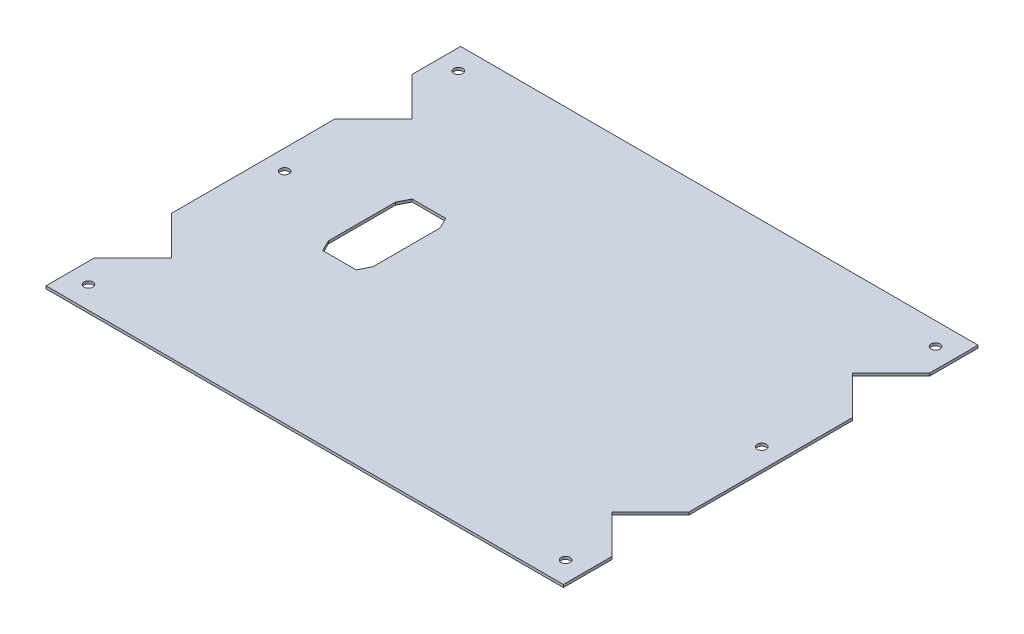
ISO-10303-21;
HEADER;
FILE_DESCRIPTION(('STEP AP214'),'2;1');
FILE_NAME('part.step','',(''),(''),'','','');
FILE_SCHEMA(('AUTOMOTIVE_DESIGN { 1 0 10303 214 1 1 1 1 }'));
ENDSEC;
DATA;
#1=APPLICATION_CONTEXT('core data for automotive mechanical design processes');
#2=APPLICATION_PROTOCOL_DEFINITION('international standard','automotive_design',2000,#1);
#3=PRODUCT_CONTEXT('',#1,'mechanical');
#4=PRODUCT('Part','Part','',(#3));
#5=PRODUCT_RELATED_PRODUCT_CATEGORY('part','',(#4));
#6=PRODUCT_DEFINITION_FORMATION('','',#4);
#7=PRODUCT_DEFINITION_CONTEXT('part definition',#1,'design');
#8=PRODUCT_DEFINITION('design','',#6,#7);
#9=PRODUCT_DEFINITION_SHAPE('','',#8);
#10=(LENGTH_UNIT() NAMED_UNIT(*) SI_UNIT(.MILLI.,.METRE.));
#11=(NAMED_UNIT(*) PLANE_ANGLE_UNIT() SI_UNIT($,.RADIAN.));
#12=(NAMED_UNIT(*) SI_UNIT($,.STERADIAN.) SOLID_ANGLE_UNIT());
#13=UNCERTAINTY_MEASURE_WITH_UNIT(LENGTH_MEASURE(1.E-05),#10,'distance_accuracy_value','');
#14=(GEOMETRIC_REPRESENTATION_CONTEXT(3) GLOBAL_UNCERTAINTY_ASSIGNED_CONTEXT((#13)) GLOBAL_UNIT_ASSIGNED_CONTEXT((#10,
#11,#12)) REPRESENTATION_CONTEXT('',''));
#15=CARTESIAN_POINT('',(0.,0.,0.));
#16=DIRECTION('',(0.,0.,1.));
#17=DIRECTION('',(1.,0.,0.));
#18=AXIS2_PLACEMENT_3D('',#15,#16,#17);
#19=CARTESIAN_POINT('',(0.,-1.2,0.));
#20=DIRECTION('',(0.,1.,0.));
#21=DIRECTION('',(0.,0.,1.));
#22=AXIS2_PLACEMENT_3D('',#19,#20,#21);
#23=PLANE('',#22);
#24=DIRECTION('',(0.707106781186545,0.,-0.70710678118655));
#25=VECTOR('',#24,1.);
#26=CARTESIAN_POINT('',(99.9739821162841,-1.20000000000001,52.4464466094067));
#27=LINE('',#26,#25);
#28=CARTESIAN_POINT('',(98.5334376675488,-1.2,53.8869910581421));
#29=VERTEX_POINT('',#28);
#30=CARTESIAN_POINT('',(115.773982116284,-1.20000000000012,36.6464466094066));
#31=VERTEX_POINT('',#30);
#32=EDGE_CURVE('E705',#29,#31,#27,.T.);
#33=ORIENTED_EDGE('',*,*,#32,.F.);
#34=DIRECTION('',(-0.707106781186543,0.,-0.707106781186552));
#35=VECTOR('',#34,1.);
#36=CARTESIAN_POINT('',(128.725646100053,-1.20000000000019,84.0791994906469));
#37=LINE('',#36,#35);
#38=CARTESIAN_POINT('',(115.773982116284,-1.20000000000012,71.1275355068776));
#39=VERTEX_POINT('',#38);
#40=EDGE_CURVE('E720',#39,#29,#37,.T.);
#41=ORIENTED_EDGE('',*,*,#40,.F.);
#42=DIRECTION('',(0.,0.,1.));
#43=VECTOR('',#42,1.);
#44=CARTESIAN_POINT('',(115.773982116284,-1.20000000000011,53.9739821162842));
#45=LINE('',#44,#43);
#46=CARTESIAN_POINT('',(115.773982116284,-1.20000000000011,92.7739821162842));
#47=VERTEX_POINT('',#46);
#48=EDGE_CURVE('E716',#39,#47,#45,.T.);
#49=ORIENTED_EDGE('',*,*,#48,.T.);
#50=DIRECTION('',(-1.,0.,0.));
#51=VECTOR('',#50,1.);
#52=CARTESIAN_POINT('',(152.773982116284,-1.20000000000036,92.7739821162843));
#53=LINE('',#52,#51);
#54=CARTESIAN_POINT('',(-115.773982116284,-1.20000000000011,92.7739821162842));
#55=VERTEX_POINT('',#54);
#56=EDGE_CURVE('E747',#47,#55,#53,.T.);
#57=ORIENTED_EDGE('',*,*,#56,.T.);
#58=DIRECTION('',(0.,0.,-1.));
#59=VECTOR('',#58,1.);
#60=CARTESIAN_POINT('',(-115.773982116284,-1.20000000000011,53.9739821162842));
#61=LINE('',#60,#59);
#62=CARTESIAN_POINT('',(-115.773982116284,-1.20000000000012,71.1275355068776));
#63=VERTEX_POINT('',#62);
#64=EDGE_CURVE('E741',#55,#63,#61,.T.);
#65=ORIENTED_EDGE('',*,*,#64,.T.);
#66=DIRECTION('',(-0.707106781186543,0.,0.707106781186552));
#67=VECTOR('',#66,1.);
#68=CARTESIAN_POINT('',(-99.9739821162842,-1.20000000000001,55.3275355068774));
#69=LINE('',#68,#67);
#70=CARTESIAN_POINT('',(-98.5334376675488,-1.19999999999999,53.886991058142));
#71=VERTEX_POINT('',#70);
#72=EDGE_CURVE('E739',#71,#63,#69,.T.);
#73=ORIENTED_EDGE('',*,*,#72,.F.);
#74=DIRECTION('',(0.707106781186545,0.,0.70710678118655));
#75=VECTOR('',#74,1.);
#76=CARTESIAN_POINT('',(-174.98597798299,-1.20000000000053,-22.5655492572994));
#77=LINE('',#76,#75);
#78=CARTESIAN_POINT('',(-115.773982116284,-1.20000000000012,36.6464466094066));
#79=VERTEX_POINT('',#78);
#80=EDGE_CURVE('E855',#79,#71,#77,.T.);
#81=ORIENTED_EDGE('',*,*,#80,.F.);
#82=DIRECTION('',(0.,0.,-1.));
#83=VECTOR('',#82,1.);
#84=CARTESIAN_POINT('',(-115.773982116284,-1.20000000000013,0.));
#85=LINE('',#84,#83);
#86=CARTESIAN_POINT('',(-115.773982116284,-1.20000000000015,-36.6464466094067));
#87=VERTEX_POINT('',#86);
#88=EDGE_CURVE('E861',#79,#87,#85,.T.);
#89=ORIENTED_EDGE('',*,*,#88,.T.);
#90=DIRECTION('',(-0.707106781186546,0.,0.707106781186549));
#91=VECTOR('',#90,1.);
#92=CARTESIAN_POINT('',(-99.9739821162841,-1.20000000000003,-52.4464466094067));
#93=LINE('',#92,#91);
#94=CARTESIAN_POINT('',(-98.5334376675488,-1.20000000000004,-53.8869910581421));
#95=VERTEX_POINT('',#94);
#96=EDGE_CURVE('E846',#95,#87,#93,.T.);
#97=ORIENTED_EDGE('',*,*,#96,.F.);
#98=DIRECTION('',(0.707106781186546,0.,0.707106781186549));
#99=VECTOR('',#98,1.);
#100=CARTESIAN_POINT('',(-128.725646100053,-1.20000000000042,-84.0791994906468));
#101=LINE('',#100,#99);
#102=CARTESIAN_POINT('',(-115.773982116284,-1.20000000000024,-71.1275355068775));
#103=VERTEX_POINT('',#102);
#104=EDGE_CURVE('E773',#103,#95,#101,.T.);
#105=ORIENTED_EDGE('',*,*,#104,.F.);
#106=DIRECTION('',(0.,0.,-1.));
#107=VECTOR('',#106,1.);
#108=CARTESIAN_POINT('',(-115.773982116284,-1.20000000000012,-53.9739821162839));
#109=LINE('',#108,#107);
#110=CARTESIAN_POINT('',(-115.773982116284,-1.2000000000004,-92.7739821162842));
#111=VERTEX_POINT('',#110);
#112=EDGE_CURVE('E784',#103,#111,#109,.T.);
#113=ORIENTED_EDGE('',*,*,#112,.T.);
#114=DIRECTION('',(1.,0.,0.));
#115=VECTOR('',#114,1.);
#116=CARTESIAN_POINT('',(152.773982116284,-1.20000000000064,-92.7739821162841));
#117=LINE('',#116,#115);
#118=CARTESIAN_POINT('',(115.773982116284,-1.2000000000004,-92.7739821162842));
#119=VERTEX_POINT('',#118);
#120=EDGE_CURVE('E793',#111,#119,#117,.T.);
#121=ORIENTED_EDGE('',*,*,#120,.T.);
#122=DIRECTION('',(0.,0.,1.));
#123=VECTOR('',#122,1.);
#124=CARTESIAN_POINT('',(115.773982116284,-1.20000000000012,-53.9739821162839));
#125=LINE('',#124,#123);
#126=CARTESIAN_POINT('',(115.773982116284,-1.20000000000024,-71.1275355068775));
#127=VERTEX_POINT('',#126);
#128=EDGE_CURVE('E790',#119,#127,#125,.T.);
#129=ORIENTED_EDGE('',*,*,#128,.T.);
#130=DIRECTION('',(0.707106781186546,0.,-0.707106781186549));
#131=VECTOR('',#130,1.);
#132=CARTESIAN_POINT('',(99.9739821162841,-1.20000000000001,-55.3275355068774));
#133=LINE('',#132,#131);
#134=CARTESIAN_POINT('',(98.5334376675488,-1.2,-53.8869910581421));
#135=VERTEX_POINT('',#134);
#136=EDGE_CURVE('E782',#135,#127,#133,.T.);
#137=ORIENTED_EDGE('',*,*,#136,.F.);
#138=DIRECTION('',(-0.707106781186546,0.,-0.707106781186549));
#139=VECTOR('',#138,1.);
#140=CARTESIAN_POINT('',(174.98597798299,-1.20000000000053,22.5655492572993));
#141=LINE('',#140,#139);
#142=CARTESIAN_POINT('',(115.773982116284,-1.20000000000012,-36.6464466094067));
#143=VERTEX_POINT('',#142);
#144=EDGE_CURVE('E828',#143,#135,#141,.T.);
#145=ORIENTED_EDGE('',*,*,#144,.F.);
#146=DIRECTION('',(0.,0.,1.));
#147=VECTOR('',#146,1.);
#148=CARTESIAN_POINT('',(115.773982116284,-1.20000000000012,0.));
#149=LINE('',#148,#147);
#150=EDGE_CURVE('E834',#143,#31,#149,.T.);
#151=ORIENTED_EDGE('',*,*,#150,.T.);
#152=EDGE_LOOP('',(#33,#41,#49,#57,#65,#73,#81,#89,#97,#105,#113,#121,#129,#137,#145,#151));
#153=FACE_BOUND('',#152,.T.);
#154=DIRECTION('',(0.,0.,-1.));
#155=VECTOR('',#154,1.);
#156=CARTESIAN_POINT('',(-70.,-1.2,12.2));
#157=LINE('',#156,#155);
#158=CARTESIAN_POINT('',(-70.,-1.2,12.2));
#159=VERTEX_POINT('',#158);
#160=CARTESIAN_POINT('',(-70.,-1.2,-17.8));
#161=VERTEX_POINT('',#160);
#162=EDGE_CURVE('E871',#159,#161,#157,.T.);
#163=ORIENTED_EDGE('',*,*,#162,.F.);
#164=DIRECTION('',(-0.447213595499958,0.,-0.894427190999916));
#165=VECTOR('',#164,1.);
#166=CARTESIAN_POINT('',(-70.,-1.2,12.2));
#167=LINE('',#166,#165);
#168=CARTESIAN_POINT('',(-67.5,-1.2,17.2));
#169=VERTEX_POINT('',#168);
#170=EDGE_CURVE('E548',#169,#159,#167,.T.);
#171=ORIENTED_EDGE('',*,*,#170,.F.);
#172=DIRECTION('',(-1.,0.,0.));
#173=VECTOR('',#172,1.);
#174=CARTESIAN_POINT('',(-67.5,-1.2,17.2));
#175=LINE('',#174,#173);
#176=CARTESIAN_POINT('',(-52.5,-1.2,17.2));
#177=VERTEX_POINT('',#176);
#178=EDGE_CURVE('E888',#177,#169,#175,.T.);
#179=ORIENTED_EDGE('',*,*,#178,.F.);
#180=DIRECTION('',(-0.447213595499956,0.,0.894427190999917));
#181=VECTOR('',#180,1.);
#182=CARTESIAN_POINT('',(-52.5,-1.2,17.2));
#183=LINE('',#182,#181);
#184=CARTESIAN_POINT('',(-50.,-1.2,12.2));
#185=VERTEX_POINT('',#184);
#186=EDGE_CURVE('E885',#185,#177,#183,.T.);
#187=ORIENTED_EDGE('',*,*,#186,.F.);
#188=DIRECTION('',(0.,0.,1.));
#189=VECTOR('',#188,1.);
#190=CARTESIAN_POINT('',(-50.,-1.2,12.2));
#191=LINE('',#190,#189);
#192=CARTESIAN_POINT('',(-50.,-1.2,-17.8));
#193=VERTEX_POINT('',#192);
#194=EDGE_CURVE('E882',#193,#185,#191,.T.);
#195=ORIENTED_EDGE('',*,*,#194,.F.);
#196=DIRECTION('',(0.447213595499956,0.,0.894427190999917));
#197=VECTOR('',#196,1.);
#198=CARTESIAN_POINT('',(-52.5,-1.2,-22.8));
#199=LINE('',#198,#197);
#200=CARTESIAN_POINT('',(-52.5,-1.2,-22.8));
#201=VERTEX_POINT('',#200);
#202=EDGE_CURVE('E879',#201,#193,#199,.T.);
#203=ORIENTED_EDGE('',*,*,#202,.F.);
#204=DIRECTION('',(1.,0.,0.));
#205=VECTOR('',#204,1.);
#206=CARTESIAN_POINT('',(-67.5,-1.2,-22.8));
#207=LINE('',#206,#205);
#208=CARTESIAN_POINT('',(-67.5,-1.2,-22.8));
#209=VERTEX_POINT('',#208);
#210=EDGE_CURVE('E876',#209,#201,#207,.T.);
#211=ORIENTED_EDGE('',*,*,#210,.F.);
#212=DIRECTION('',(0.44721359549996,0.,-0.894427190999915));
#213=VECTOR('',#212,1.);
#214=CARTESIAN_POINT('',(-70.,-1.2,-17.8));
#215=LINE('',#214,#213);
#216=EDGE_CURVE('E873',#161,#209,#215,.T.);
#217=ORIENTED_EDGE('',*,*,#216,.F.);
#218=EDGE_LOOP('',(#163,#171,#179,#187,#195,#203,#211,#217));
#219=FACE_BOUND('',#218,.T.);
#220=CARTESIAN_POINT('',(-106.773982116284,-1.20000000000012,-5.00000000000015));
#221=DIRECTION('',(0.,1.,0.));
#222=DIRECTION('',(0.,0.,-1.));
#223=AXIS2_PLACEMENT_3D('',#220,#221,#222);
#224=CIRCLE('',#223,2.);
#225=CARTESIAN_POINT('',(-106.773982116284,-1.20000000000012,-7.00000000000015));
#226=VERTEX_POINT('',#225);
#227=EDGE_CURVE('E863',#226,#226,#224,.T.);
#228=ORIENTED_EDGE('',*,*,#227,.T.);
#229=EDGE_LOOP('',(#228));
#230=FACE_BOUND('',#229,.T.);
#231=CARTESIAN_POINT('',(106.773982116284,-1.20000000000009,-5.00000000000015));
#232=DIRECTION('',(0.,-1.,0.));
#233=DIRECTION('',(0.,0.,-1.));
#234=AXIS2_PLACEMENT_3D('',#231,#232,#233);
#235=CIRCLE('',#234,2.);
#236=CARTESIAN_POINT('',(106.773982116284,-1.20000000000009,-7.00000000000015));
#237=VERTEX_POINT('',#236);
#238=EDGE_CURVE('E836',#237,#237,#235,.T.);
#239=ORIENTED_EDGE('',*,*,#238,.F.);
#240=EDGE_LOOP('',(#239));
#241=FACE_BOUND('',#240,.T.);
#242=CARTESIAN_POINT('',(-106.773982116284,-1.20000000000027,-82.7739821162841));
#243=DIRECTION('',(0.,1.,0.));
#244=DIRECTION('',(1.,0.,0.));
#245=AXIS2_PLACEMENT_3D('',#242,#243,#244);
#246=CIRCLE('',#245,2.);
#247=CARTESIAN_POINT('',(-104.773982116284,-1.20000000000026,-82.7739821162841));
#248=VERTEX_POINT('',#247);
#249=EDGE_CURVE('E787',#248,#248,#246,.T.);
#250=ORIENTED_EDGE('',*,*,#249,.T.);
#251=EDGE_LOOP('',(#250));
#252=FACE_BOUND('',#251,.T.);
#253=CARTESIAN_POINT('',(106.773982116284,-1.20000000000028,-82.7739821162841));
#254=DIRECTION('',(0.,-1.,0.));
#255=DIRECTION('',(-1.,0.,0.));
#256=AXIS2_PLACEMENT_3D('',#253,#254,#255);
#257=CIRCLE('',#256,2.);
#258=CARTESIAN_POINT('',(104.773982116284,-1.20000000000028,-82.7739821162841));
#259=VERTEX_POINT('',#258);
#260=EDGE_CURVE('E818',#259,#259,#257,.T.);
#261=ORIENTED_EDGE('',*,*,#260,.F.);
#262=EDGE_LOOP('',(#261));
#263=FACE_BOUND('',#262,.T.);
#264=CARTESIAN_POINT('',(-106.773982116284,-1.2000000000001,82.7739821162842));
#265=DIRECTION('',(0.,1.,0.));
#266=DIRECTION('',(-1.,0.,0.));
#267=AXIS2_PLACEMENT_3D('',#264,#265,#266);
#268=CIRCLE('',#267,2.);
#269=CARTESIAN_POINT('',(-108.773982116284,-1.2000000000001,82.7739821162842));
#270=VERTEX_POINT('',#269);
#271=EDGE_CURVE('E744',#270,#270,#268,.T.);
#272=ORIENTED_EDGE('',*,*,#271,.T.);
#273=EDGE_LOOP('',(#272));
#274=FACE_BOUND('',#273,.T.);
#275=CARTESIAN_POINT('',(106.773982116284,-1.20000000000007,82.7739821162842));
#276=DIRECTION('',(0.,-1.,0.));
#277=DIRECTION('',(1.,0.,0.));
#278=AXIS2_PLACEMENT_3D('',#275,#276,#277);
#279=CIRCLE('',#278,2.);
#280=CARTESIAN_POINT('',(108.773982116284,-1.20000000000008,82.7739821162842));
#281=VERTEX_POINT('',#280);
#282=EDGE_CURVE('E763',#281,#281,#279,.T.);
#283=ORIENTED_EDGE('',*,*,#282,.F.);
#284=EDGE_LOOP('',(#283));
#285=FACE_BOUND('',#284,.T.);
#286=ADVANCED_FACE('F533',(#153,#219,#230,#241,#252,#263,#274,#285),#23,.F.);
#287=CARTESIAN_POINT('',(0.,0.,0.));
#288=DIRECTION('',(0.,1.,0.));
#289=DIRECTION('',(0.,0.,1.));
#290=AXIS2_PLACEMENT_3D('',#287,#288,#289);
#291=PLANE('',#290);
#292=DIRECTION('',(-0.707106781186543,0.,-0.707106781186552));
#293=VECTOR('',#292,1.);
#294=CARTESIAN_POINT('',(125.697205420987,-1.73472347597681E-13,81.0507588115807));
#295=LINE('',#294,#293);
#296=CARTESIAN_POINT('',(115.773982116284,-1.11022302462516E-13,71.1275355068776));
#297=VERTEX_POINT('',#296);
#298=CARTESIAN_POINT('',(98.5334376675488,0.,53.8869910581421));
#299=VERTEX_POINT('',#298);
#300=EDGE_CURVE('E710',#297,#299,#295,.T.);
#301=ORIENTED_EDGE('',*,*,#300,.T.);
#302=DIRECTION('',(0.707106781186545,0.,-0.70710678118655));
#303=VECTOR('',#302,1.);
#304=CARTESIAN_POINT('',(125.697205420987,-1.94289029309402E-13,26.7232233047033));
#305=LINE('',#304,#303);
#306=CARTESIAN_POINT('',(115.773982116284,0.,36.6464466094066));
#307=VERTEX_POINT('',#306);
#308=EDGE_CURVE('E695',#299,#307,#305,.T.);
#309=ORIENTED_EDGE('',*,*,#308,.T.);
#310=DIRECTION('',(0.,0.,-1.));
#311=VECTOR('',#310,1.);
#312=CARTESIAN_POINT('',(115.773982116284,-1.11022302462516E-13,52.8));
#313=LINE('',#312,#311);
#314=CARTESIAN_POINT('',(115.773982116284,0.,-36.6464466094067));
#315=VERTEX_POINT('',#314);
#316=EDGE_CURVE('E776',#315,#307,#313,.F.);
#317=ORIENTED_EDGE('',*,*,#316,.F.);
#318=DIRECTION('',(-0.707106781186546,0.,-0.707106781186549));
#319=VECTOR('',#318,1.);
#320=CARTESIAN_POINT('',(125.697205420987,-1.80411241501588E-13,-26.7232233047034));
#321=LINE('',#320,#319);
#322=CARTESIAN_POINT('',(98.5334376675488,0.,-53.8869910581421));
#323=VERTEX_POINT('',#322);
#324=EDGE_CURVE('E706',#315,#323,#321,.T.);
#325=ORIENTED_EDGE('',*,*,#324,.T.);
#326=DIRECTION('',(0.707106781186546,0.,-0.707106781186549));
#327=VECTOR('',#326,1.);
#328=CARTESIAN_POINT('',(125.697205420987,-3.7470027081099E-13,-81.0507588115805));
#329=LINE('',#328,#327);
#330=CARTESIAN_POINT('',(115.773982116284,-2.28983498828939E-13,-71.1275355068775));
#331=VERTEX_POINT('',#330);
#332=EDGE_CURVE('E801',#323,#331,#329,.T.);
#333=ORIENTED_EDGE('',*,*,#332,.T.);
#334=DIRECTION('',(0.,0.,-1.));
#335=VECTOR('',#334,1.);
#336=CARTESIAN_POINT('',(115.773982116284,-1.17961196366423E-13,-54.9739821162841));
#337=LINE('',#336,#335);
#338=CARTESIAN_POINT('',(115.773982116284,-3.88578058618805E-13,-92.7739821162842));
#339=VERTEX_POINT('',#338);
#340=EDGE_CURVE('E804',#339,#331,#337,.F.);
#341=ORIENTED_EDGE('',*,*,#340,.F.);
#342=DIRECTION('',(-1.,0.,0.));
#343=VECTOR('',#342,1.);
#344=CARTESIAN_POINT('',(115.773982116284,-3.88578058618805E-13,-92.7739821162842));
#345=LINE('',#344,#343);
#346=CARTESIAN_POINT('',(-115.773982116284,-3.88578058618805E-13,-92.7739821162842));
#347=VERTEX_POINT('',#346);
#348=EDGE_CURVE('E816',#347,#339,#345,.F.);
#349=ORIENTED_EDGE('',*,*,#348,.F.);
#350=DIRECTION('',(0.,0.,1.));
#351=VECTOR('',#350,1.);
#352=CARTESIAN_POINT('',(-115.773982116284,-3.88578058618805E-13,-92.7739821162842));
#353=LINE('',#352,#351);
#354=CARTESIAN_POINT('',(-115.773982116284,-2.28983498828939E-13,-71.1275355068775));
#355=VERTEX_POINT('',#354);
#356=EDGE_CURVE('E798',#355,#347,#353,.F.);
#357=ORIENTED_EDGE('',*,*,#356,.F.);
#358=DIRECTION('',(0.707106781186546,0.,0.707106781186549));
#359=VECTOR('',#358,1.);
#360=CARTESIAN_POINT('',(-125.697205420987,-3.7470027081099E-13,-81.0507588115805));
#361=LINE('',#360,#359);
#362=CARTESIAN_POINT('',(-98.5334376675488,0.,-53.8869910581421));
#363=VERTEX_POINT('',#362);
#364=EDGE_CURVE('E795',#355,#363,#361,.T.);
#365=ORIENTED_EDGE('',*,*,#364,.T.);
#366=DIRECTION('',(-0.707106781186546,0.,0.707106781186549));
#367=VECTOR('',#366,1.);
#368=CARTESIAN_POINT('',(-125.697205420987,-2.08166817117217E-13,-26.7232233047034));
#369=LINE('',#368,#367);
#370=CARTESIAN_POINT('',(-115.773982116284,-1.11022302462516E-13,-36.6464466094067));
#371=VERTEX_POINT('',#370);
#372=EDGE_CURVE('E849',#363,#371,#369,.T.);
#373=ORIENTED_EDGE('',*,*,#372,.T.);
#374=DIRECTION('',(0.,0.,1.));
#375=VECTOR('',#374,1.);
#376=CARTESIAN_POINT('',(-115.773982116284,-1.38777878078145E-13,-52.8));
#377=LINE('',#376,#375);
#378=CARTESIAN_POINT('',(-115.773982116284,-1.11022302462516E-13,36.6464466094066));
#379=VERTEX_POINT('',#378);
#380=EDGE_CURVE('E824',#379,#371,#377,.F.);
#381=ORIENTED_EDGE('',*,*,#380,.F.);
#382=DIRECTION('',(0.707106781186545,0.,0.70710678118655));
#383=VECTOR('',#382,1.);
#384=CARTESIAN_POINT('',(-125.697205420987,-1.94289029309402E-13,26.7232233047033));
#385=LINE('',#384,#383);
#386=CARTESIAN_POINT('',(-98.5334376675489,0.,53.886991058142));
#387=VERTEX_POINT('',#386);
#388=EDGE_CURVE('E852',#379,#387,#385,.T.);
#389=ORIENTED_EDGE('',*,*,#388,.T.);
#390=DIRECTION('',(-0.707106781186543,0.,0.707106781186552));
#391=VECTOR('',#390,1.);
#392=CARTESIAN_POINT('',(-125.697205420987,-1.73472347597681E-13,81.0507588115807));
#393=LINE('',#392,#391);
#394=CARTESIAN_POINT('',(-115.773982116284,-1.11022302462516E-13,71.1275355068776));
#395=VERTEX_POINT('',#394);
#396=EDGE_CURVE('E751',#387,#395,#393,.T.);
#397=ORIENTED_EDGE('',*,*,#396,.T.);
#398=DIRECTION('',(0.,0.,1.));
#399=VECTOR('',#398,1.);
#400=CARTESIAN_POINT('',(-115.773982116284,-1.11022302462516E-13,54.9739821162842));
#401=LINE('',#400,#399);
#402=CARTESIAN_POINT('',(-115.773982116284,-1.04083408558608E-13,92.7739821162842));
#403=VERTEX_POINT('',#402);
#404=EDGE_CURVE('E754',#403,#395,#401,.F.);
#405=ORIENTED_EDGE('',*,*,#404,.F.);
#406=DIRECTION('',(1.,0.,0.));
#407=VECTOR('',#406,1.);
#408=CARTESIAN_POINT('',(98.973982116284,0.,92.7739821162842));
#409=LINE('',#408,#407);
#410=CARTESIAN_POINT('',(115.773982116284,-1.04083408558608E-13,92.7739821162842));
#411=VERTEX_POINT('',#410);
#412=EDGE_CURVE('E769',#411,#403,#409,.F.);
#413=ORIENTED_EDGE('',*,*,#412,.F.);
#414=DIRECTION('',(0.,0.,-1.));
#415=VECTOR('',#414,1.);
#416=CARTESIAN_POINT('',(115.773982116284,-1.04083408558608E-13,92.7739821162842));
#417=LINE('',#416,#415);
#418=EDGE_CURVE('E713',#297,#411,#417,.F.);
#419=ORIENTED_EDGE('',*,*,#418,.F.);
#420=EDGE_LOOP('',(#301,#309,#317,#325,#333,#341,#349,#357,#365,#373,#381,#389,#397,#405,#413,#419));
#421=FACE_BOUND('',#420,.T.);
#422=DIRECTION('',(0.447213595499958,0.,0.894427190999916));
#423=VECTOR('',#422,1.);
#424=CARTESIAN_POINT('',(-60.88,0.,30.44));
#425=LINE('',#424,#423);
#426=CARTESIAN_POINT('',(-70.,0.,12.2));
#427=VERTEX_POINT('',#426);
#428=CARTESIAN_POINT('',(-67.5,0.,17.2));
#429=VERTEX_POINT('',#428);
#430=EDGE_CURVE('E13',#427,#429,#425,.T.);
#431=ORIENTED_EDGE('',*,*,#430,.F.);
#432=DIRECTION('',(0.,0.,1.));
#433=VECTOR('',#432,1.);
#434=CARTESIAN_POINT('',(-70.,0.,0.));
#435=LINE('',#434,#433);
#436=CARTESIAN_POINT('',(-70.,0.,-17.8));
#437=VERTEX_POINT('',#436);
#438=EDGE_CURVE('E894',#437,#427,#435,.T.);
#439=ORIENTED_EDGE('',*,*,#438,.F.);
#440=DIRECTION('',(-0.44721359549996,0.,0.894427190999915));
#441=VECTOR('',#440,1.);
#442=CARTESIAN_POINT('',(-63.1199999999999,0.,-31.5600000000001));
#443=LINE('',#442,#441);
#444=CARTESIAN_POINT('',(-67.5,0.,-22.8));
#445=VERTEX_POINT('',#444);
#446=EDGE_CURVE('E908',#445,#437,#443,.T.);
#447=ORIENTED_EDGE('',*,*,#446,.F.);
#448=DIRECTION('',(-1.,0.,0.));
#449=VECTOR('',#448,1.);
#450=CARTESIAN_POINT('',(0.,0.,-22.8));
#451=LINE('',#450,#449);
#452=CARTESIAN_POINT('',(-52.5,0.,-22.8));
#453=VERTEX_POINT('',#452);
#454=EDGE_CURVE('E910',#453,#445,#451,.T.);
#455=ORIENTED_EDGE('',*,*,#454,.F.);
#456=DIRECTION('',(-0.447213595499956,0.,-0.894427190999917));
#457=VECTOR('',#456,1.);
#458=CARTESIAN_POINT('',(-32.8800000000001,0.,16.44));
#459=LINE('',#458,#457);
#460=CARTESIAN_POINT('',(-50.,0.,-17.8));
#461=VERTEX_POINT('',#460);
#462=EDGE_CURVE('E912',#461,#453,#459,.T.);
#463=ORIENTED_EDGE('',*,*,#462,.F.);
#464=DIRECTION('',(0.,0.,-1.));
#465=VECTOR('',#464,1.);
#466=CARTESIAN_POINT('',(-50.,0.,0.));
#467=LINE('',#466,#465);
#468=CARTESIAN_POINT('',(-50.,0.,12.2));
#469=VERTEX_POINT('',#468);
#470=EDGE_CURVE('E914',#469,#461,#467,.T.);
#471=ORIENTED_EDGE('',*,*,#470,.F.);
#472=DIRECTION('',(0.447213595499956,0.,-0.894427190999917));
#473=VECTOR('',#472,1.);
#474=CARTESIAN_POINT('',(-35.1200000000001,0.,-17.56));
#475=LINE('',#474,#473);
#476=CARTESIAN_POINT('',(-52.5,0.,17.2));
#477=VERTEX_POINT('',#476);
#478=EDGE_CURVE('E916',#477,#469,#475,.T.);
#479=ORIENTED_EDGE('',*,*,#478,.F.);
#480=DIRECTION('',(1.,0.,0.));
#481=VECTOR('',#480,1.);
#482=CARTESIAN_POINT('',(0.,0.,17.2));
#483=LINE('',#482,#481);
#484=EDGE_CURVE('E541',#429,#477,#483,.T.);
#485=ORIENTED_EDGE('',*,*,#484,.F.);
#486=EDGE_LOOP('',(#431,#439,#447,#455,#463,#471,#479,#485));
#487=FACE_BOUND('',#486,.T.);
#488=CARTESIAN_POINT('',(-106.773982116284,0.,-5.00000000000015));
#489=DIRECTION('',(0.,1.,0.));
#490=DIRECTION('',(-1.,0.,0.));
#491=AXIS2_PLACEMENT_3D('',#488,#489,#490);
#492=CIRCLE('',#491,2.);
#493=CARTESIAN_POINT('',(-108.773982116284,0.,-5.00000000000015));
#494=VERTEX_POINT('',#493);
#495=EDGE_CURVE('E866',#494,#494,#492,.T.);
#496=ORIENTED_EDGE('',*,*,#495,.F.);
#497=EDGE_LOOP('',(#496));
#498=FACE_BOUND('',#497,.T.);
#499=CARTESIAN_POINT('',(106.773982116284,0.,-5.00000000000015));
#500=DIRECTION('',(0.,1.,0.));
#501=DIRECTION('',(-1.,0.,0.));
#502=AXIS2_PLACEMENT_3D('',#499,#500,#501);
#503=CIRCLE('',#502,2.);
#504=CARTESIAN_POINT('',(104.773982116284,0.,-5.00000000000015));
#505=VERTEX_POINT('',#504);
#506=EDGE_CURVE('E839',#505,#505,#503,.T.);
#507=ORIENTED_EDGE('',*,*,#506,.F.);
#508=EDGE_LOOP('',(#507));
#509=FACE_BOUND('',#508,.T.);
#510=CARTESIAN_POINT('',(-106.773982116284,-2.35922392732846E-13,-82.7739821162841));
#511=DIRECTION('',(0.,1.,0.));
#512=DIRECTION('',(1.,0.,0.));
#513=AXIS2_PLACEMENT_3D('',#510,#511,#512);
#514=CIRCLE('',#513,2.);
#515=CARTESIAN_POINT('',(-104.773982116284,-2.22330959670486E-13,-82.7739821162841));
#516=VERTEX_POINT('',#515);
#517=EDGE_CURVE('E810',#516,#516,#514,.T.);
#518=ORIENTED_EDGE('',*,*,#517,.F.);
#519=EDGE_LOOP('',(#518));
#520=FACE_BOUND('',#519,.T.);
#521=CARTESIAN_POINT('',(106.773982116284,-2.63677968348475E-13,-82.7739821162841));
#522=DIRECTION('',(0.,1.,0.));
#523=DIRECTION('',(1.,0.,0.));
#524=AXIS2_PLACEMENT_3D('',#521,#522,#523);
#525=CIRCLE('',#524,2.);
#526=CARTESIAN_POINT('',(108.773982116284,-2.77269401410834E-13,-82.7739821162841));
#527=VERTEX_POINT('',#526);
#528=EDGE_CURVE('E734',#527,#527,#525,.T.);
#529=ORIENTED_EDGE('',*,*,#528,.F.);
#530=EDGE_LOOP('',(#529));
#531=FACE_BOUND('',#530,.T.);
#532=CARTESIAN_POINT('',(106.773982116284,0.,82.7739821162842));
#533=DIRECTION('',(0.,1.,0.));
#534=DIRECTION('',(-1.,0.,0.));
#535=AXIS2_PLACEMENT_3D('',#532,#533,#534);
#536=CIRCLE('',#535,2.);
#537=CARTESIAN_POINT('',(104.773982116284,0.,82.7739821162842));
#538=VERTEX_POINT('',#537);
#539=EDGE_CURVE('E766',#538,#538,#536,.T.);
#540=ORIENTED_EDGE('',*,*,#539,.F.);
#541=EDGE_LOOP('',(#540));
#542=FACE_BOUND('',#541,.T.);
#543=CARTESIAN_POINT('',(-106.773982116284,0.,82.7739821162842));
#544=DIRECTION('',(0.,1.,0.));
#545=DIRECTION('',(-1.,0.,0.));
#546=AXIS2_PLACEMENT_3D('',#543,#544,#545);
#547=CIRCLE('',#546,2.);
#548=CARTESIAN_POINT('',(-108.773982116284,0.,82.7739821162842));
#549=VERTEX_POINT('',#548);
#550=EDGE_CURVE('E760',#549,#549,#547,.T.);
#551=ORIENTED_EDGE('',*,*,#550,.F.);
#552=EDGE_LOOP('',(#551));
#553=FACE_BOUND('',#552,.T.);
#554=ADVANCED_FACE('F535',(#421,#487,#498,#509,#520,#531,#542,#553),#291,.T.);
#555=CARTESIAN_POINT('',(-70.,38.8000000000001,12.2));
#556=DIRECTION('',(-0.894427190999916,0.,0.447213595499958));
#557=DIRECTION('',(0.447213595499958,0.,0.894427190999916));
#558=AXIS2_PLACEMENT_3D('',#555,#556,#557);
#559=PLANE('',#558);
#560=ORIENTED_EDGE('',*,*,#430,.T.);
#561=DIRECTION('',(0.,-1.,0.));
#562=VECTOR('',#561,1.);
#563=CARTESIAN_POINT('',(-67.5,38.8000000000001,17.2));
#564=LINE('',#563,#562);
#565=EDGE_CURVE('E892',#429,#169,#564,.T.);
#566=ORIENTED_EDGE('',*,*,#565,.T.);
#567=ORIENTED_EDGE('',*,*,#170,.T.);
#568=DIRECTION('',(0.,-1.,0.));
#569=VECTOR('',#568,1.);
#570=CARTESIAN_POINT('',(-70.,38.8000000000001,12.2));
#571=LINE('',#570,#569);
#572=EDGE_CURVE('E891',#427,#159,#571,.T.);
#573=ORIENTED_EDGE('',*,*,#572,.F.);
#574=EDGE_LOOP('',(#560,#566,#567,#573));
#575=FACE_BOUND('',#574,.T.);
#576=ADVANCED_FACE('F948',(#575),#559,.F.);
#577=CARTESIAN_POINT('',(-67.5,38.8000000000001,17.2));
#578=DIRECTION('',(0.,0.,1.));
#579=DIRECTION('',(1.,0.,0.));
#580=AXIS2_PLACEMENT_3D('',#577,#578,#579);
#581=PLANE('',#580);
#582=ORIENTED_EDGE('',*,*,#484,.T.);
#583=DIRECTION('',(0.,-1.,0.));
#584=VECTOR('',#583,1.);
#585=CARTESIAN_POINT('',(-52.5,38.8000000000001,17.2));
#586=LINE('',#585,#584);
#587=EDGE_CURVE('E895',#477,#177,#586,.T.);
#588=ORIENTED_EDGE('',*,*,#587,.T.);
#589=ORIENTED_EDGE('',*,*,#178,.T.);
#590=ORIENTED_EDGE('',*,*,#565,.F.);
#591=EDGE_LOOP('',(#582,#588,#589,#590));
#592=FACE_BOUND('',#591,.T.);
#593=ADVANCED_FACE('F921',(#592),#581,.F.);
#594=CARTESIAN_POINT('',(-52.5,38.8000000000001,17.2));
#595=DIRECTION('',(0.894427190999917,0.,0.447213595499956));
#596=DIRECTION('',(0.447213595499956,0.,-0.894427190999917));
#597=AXIS2_PLACEMENT_3D('',#594,#595,#596);
#598=PLANE('',#597);
#599=ORIENTED_EDGE('',*,*,#478,.T.);
#600=DIRECTION('',(0.,-1.,0.));
#601=VECTOR('',#600,1.);
#602=CARTESIAN_POINT('',(-50.,38.8000000000001,12.2));
#603=LINE('',#602,#601);
#604=EDGE_CURVE('E897',#469,#185,#603,.T.);
#605=ORIENTED_EDGE('',*,*,#604,.T.);
#606=ORIENTED_EDGE('',*,*,#186,.T.);
#607=ORIENTED_EDGE('',*,*,#587,.F.);
#608=EDGE_LOOP('',(#599,#605,#606,#607));
#609=FACE_BOUND('',#608,.T.);
#610=ADVANCED_FACE('F925',(#609),#598,.F.);
#611=CARTESIAN_POINT('',(-50.,38.8000000000001,12.2));
#612=DIRECTION('',(1.,0.,0.));
#613=DIRECTION('',(0.,0.,-1.));
#614=AXIS2_PLACEMENT_3D('',#611,#612,#613);
#615=PLANE('',#614);
#616=ORIENTED_EDGE('',*,*,#470,.T.);
#617=DIRECTION('',(0.,-1.,0.));
#618=VECTOR('',#617,1.);
#619=CARTESIAN_POINT('',(-50.,38.8000000000001,-17.8));
#620=LINE('',#619,#618);
#621=EDGE_CURVE('E899',#461,#193,#620,.T.);
#622=ORIENTED_EDGE('',*,*,#621,.T.);
#623=ORIENTED_EDGE('',*,*,#194,.T.);
#624=ORIENTED_EDGE('',*,*,#604,.F.);
#625=EDGE_LOOP('',(#616,#622,#623,#624));
#626=FACE_BOUND('',#625,.T.);
#627=ADVANCED_FACE('F935',(#626),#615,.F.);
#628=CARTESIAN_POINT('',(-52.5,38.8000000000001,-22.8));
#629=DIRECTION('',(0.894427190999917,0.,-0.447213595499956));
#630=DIRECTION('',(-0.447213595499956,0.,-0.894427190999917));
#631=AXIS2_PLACEMENT_3D('',#628,#629,#630);
#632=PLANE('',#631);
#633=ORIENTED_EDGE('',*,*,#462,.T.);
#634=DIRECTION('',(0.,-1.,0.));
#635=VECTOR('',#634,1.);
#636=CARTESIAN_POINT('',(-52.5,38.8000000000001,-22.8));
#637=LINE('',#636,#635);
#638=EDGE_CURVE('E901',#453,#201,#637,.T.);
#639=ORIENTED_EDGE('',*,*,#638,.T.);
#640=ORIENTED_EDGE('',*,*,#202,.T.);
#641=ORIENTED_EDGE('',*,*,#621,.F.);
#642=EDGE_LOOP('',(#633,#639,#640,#641));
#643=FACE_BOUND('',#642,.T.);
#644=ADVANCED_FACE('F937',(#643),#632,.F.);
#645=CARTESIAN_POINT('',(-67.5,38.8000000000001,-22.8));
#646=DIRECTION('',(0.,0.,-1.));
#647=DIRECTION('',(-1.,0.,0.));
#648=AXIS2_PLACEMENT_3D('',#645,#646,#647);
#649=PLANE('',#648);
#650=ORIENTED_EDGE('',*,*,#454,.T.);
#651=DIRECTION('',(0.,-1.,0.));
#652=VECTOR('',#651,1.);
#653=CARTESIAN_POINT('',(-67.5,38.8000000000001,-22.8));
#654=LINE('',#653,#652);
#655=EDGE_CURVE('E903',#445,#209,#654,.T.);
#656=ORIENTED_EDGE('',*,*,#655,.T.);
#657=ORIENTED_EDGE('',*,*,#210,.T.);
#658=ORIENTED_EDGE('',*,*,#638,.F.);
#659=EDGE_LOOP('',(#650,#656,#657,#658));
#660=FACE_BOUND('',#659,.T.);
#661=ADVANCED_FACE('F954',(#660),#649,.F.);
#662=CARTESIAN_POINT('',(-70.,38.8000000000001,-17.8));
#663=DIRECTION('',(-0.894427190999915,0.,-0.44721359549996));
#664=DIRECTION('',(-0.44721359549996,0.,0.894427190999915));
#665=AXIS2_PLACEMENT_3D('',#662,#663,#664);
#666=PLANE('',#665);
#667=ORIENTED_EDGE('',*,*,#446,.T.);
#668=DIRECTION('',(0.,-1.,0.));
#669=VECTOR('',#668,1.);
#670=CARTESIAN_POINT('',(-70.,38.8000000000001,-17.8));
#671=LINE('',#670,#669);
#672=EDGE_CURVE('E556',#437,#161,#671,.T.);
#673=ORIENTED_EDGE('',*,*,#672,.T.);
#674=ORIENTED_EDGE('',*,*,#216,.T.);
#675=ORIENTED_EDGE('',*,*,#655,.F.);
#676=EDGE_LOOP('',(#667,#673,#674,#675));
#677=FACE_BOUND('',#676,.T.);
#678=ADVANCED_FACE('F952',(#677),#666,.F.);
#679=CARTESIAN_POINT('',(-70.,38.8000000000001,12.2));
#680=DIRECTION('',(-1.,0.,0.));
#681=DIRECTION('',(0.,0.,1.));
#682=AXIS2_PLACEMENT_3D('',#679,#680,#681);
#683=PLANE('',#682);
#684=ORIENTED_EDGE('',*,*,#438,.T.);
#685=ORIENTED_EDGE('',*,*,#572,.T.);
#686=ORIENTED_EDGE('',*,*,#162,.T.);
#687=ORIENTED_EDGE('',*,*,#672,.F.);
#688=EDGE_LOOP('',(#684,#685,#686,#687));
#689=FACE_BOUND('',#688,.T.);
#690=ADVANCED_FACE('F946',(#689),#683,.F.);
#691=CARTESIAN_POINT('',(-115.773982116284,-1.20000000000015,-52.8));
#692=DIRECTION('',(1.,0.,0.));
#693=DIRECTION('',(0.,1.,0.));
#694=AXIS2_PLACEMENT_3D('',#691,#692,#693);
#695=PLANE('',#694);
#696=DIRECTION('',(0.,-1.,0.));
#697=VECTOR('',#696,1.);
#698=CARTESIAN_POINT('',(-115.773982116284,-1.20000000000012,36.6464466094066));
#699=LINE('',#698,#697);
#700=EDGE_CURVE('E858',#379,#79,#699,.T.);
#701=ORIENTED_EDGE('',*,*,#700,.F.);
#702=ORIENTED_EDGE('',*,*,#380,.T.);
#703=DIRECTION('',(0.,1.,0.));
#704=VECTOR('',#703,1.);
#705=CARTESIAN_POINT('',(-115.773982116284,-1.20000000000015,-36.6464466094067));
#706=LINE('',#705,#704);
#707=EDGE_CURVE('E843',#87,#371,#706,.T.);
#708=ORIENTED_EDGE('',*,*,#707,.F.);
#709=ORIENTED_EDGE('',*,*,#88,.F.);
#710=EDGE_LOOP('',(#701,#702,#708,#709));
#711=FACE_BOUND('',#710,.T.);
#712=ADVANCED_FACE('F972',(#711),#695,.F.);
#713=CARTESIAN_POINT('',(-106.773982116284,-1.20000000000012,-5.00000000000015));
#714=DIRECTION('',(0.,1.,0.));
#715=DIRECTION('',(0.,0.,-1.));
#716=AXIS2_PLACEMENT_3D('',#713,#714,#715);
#717=CYLINDRICAL_SURFACE('',#716,2.);
#718=ORIENTED_EDGE('',*,*,#495,.T.);
#719=EDGE_LOOP('',(#718));
#720=FACE_BOUND('',#719,.T.);
#721=ORIENTED_EDGE('',*,*,#227,.F.);
#722=EDGE_LOOP('',(#721));
#723=FACE_BOUND('',#722,.T.);
#724=ADVANCED_FACE('F976',(#720,#723),#717,.F.);
#725=CARTESIAN_POINT('',(-174.98597798299,-1.20000000000053,-22.5655492572994));
#726=DIRECTION('',(-0.70710678118655,0.,0.707106781186545));
#727=DIRECTION('',(0.707106781186545,0.,0.70710678118655));
#728=AXIS2_PLACEMENT_3D('',#725,#726,#727);
#729=PLANE('',#728);
#730=ORIENTED_EDGE('',*,*,#388,.F.);
#731=ORIENTED_EDGE('',*,*,#700,.T.);
#732=ORIENTED_EDGE('',*,*,#80,.T.);
#733=DIRECTION('',(0.,-1.,0.));
#734=VECTOR('',#733,1.);
#735=CARTESIAN_POINT('',(-98.5334376675489,0.,53.886991058142));
#736=LINE('',#735,#734);
#737=EDGE_CURVE('E724',#387,#71,#736,.T.);
#738=ORIENTED_EDGE('',*,*,#737,.F.);
#739=EDGE_LOOP('',(#730,#731,#732,#738));
#740=FACE_BOUND('',#739,.T.);
#741=ADVANCED_FACE('F982',(#740),#729,.T.);
#742=CARTESIAN_POINT('',(-99.9739821162841,-1.20000000000003,-52.4464466094067));
#743=DIRECTION('',(-0.707106781186549,0.,-0.707106781186546));
#744=DIRECTION('',(-0.707106781186546,0.,0.707106781186549));
#745=AXIS2_PLACEMENT_3D('',#742,#743,#744);
#746=PLANE('',#745);
#747=ORIENTED_EDGE('',*,*,#372,.F.);
#748=DIRECTION('',(0.,-1.,0.));
#749=VECTOR('',#748,1.);
#750=CARTESIAN_POINT('',(-98.5334376675488,0.,-53.8869910581421));
#751=LINE('',#750,#749);
#752=EDGE_CURVE('E729',#363,#95,#751,.T.);
#753=ORIENTED_EDGE('',*,*,#752,.T.);
#754=ORIENTED_EDGE('',*,*,#96,.T.);
#755=ORIENTED_EDGE('',*,*,#707,.T.);
#756=EDGE_LOOP('',(#747,#753,#754,#755));
#757=FACE_BOUND('',#756,.T.);
#758=ADVANCED_FACE('F990',(#757),#746,.T.);
#759=CARTESIAN_POINT('',(115.773982116284,-1.20000000000012,52.8));
#760=DIRECTION('',(-1.,0.,0.));
#761=DIRECTION('',(0.,-1.,0.));
#762=AXIS2_PLACEMENT_3D('',#759,#760,#761);
#763=PLANE('',#762);
#764=DIRECTION('',(0.,-1.,0.));
#765=VECTOR('',#764,1.);
#766=CARTESIAN_POINT('',(115.773982116284,-1.20000000000009,-36.6464466094067));
#767=LINE('',#766,#765);
#768=EDGE_CURVE('E831',#315,#143,#767,.T.);
#769=ORIENTED_EDGE('',*,*,#768,.F.);
#770=ORIENTED_EDGE('',*,*,#316,.T.);
#771=DIRECTION('',(0.,1.,0.));
#772=VECTOR('',#771,1.);
#773=CARTESIAN_POINT('',(115.773982116284,-1.20000000000012,36.6464466094066));
#774=LINE('',#773,#772);
#775=EDGE_CURVE('E702',#31,#307,#774,.T.);
#776=ORIENTED_EDGE('',*,*,#775,.F.);
#777=ORIENTED_EDGE('',*,*,#150,.F.);
#778=EDGE_LOOP('',(#769,#770,#776,#777));
#779=FACE_BOUND('',#778,.T.);
#780=ADVANCED_FACE('F994',(#779),#763,.F.);
#781=CARTESIAN_POINT('',(106.773982116285,198.8,-5.00000000000017));
#782=DIRECTION('',(0.,-1.,0.));
#783=DIRECTION('',(0.,0.,-1.));
#784=AXIS2_PLACEMENT_3D('',#781,#782,#783);
#785=CYLINDRICAL_SURFACE('',#784,2.);
#786=ORIENTED_EDGE('',*,*,#506,.T.);
#787=EDGE_LOOP('',(#786));
#788=FACE_BOUND('',#787,.T.);
#789=ORIENTED_EDGE('',*,*,#238,.T.);
#790=EDGE_LOOP('',(#789));
#791=FACE_BOUND('',#790,.T.);
#792=ADVANCED_FACE('F1062',(#788,#791),#785,.F.);
#793=CARTESIAN_POINT('',(174.98597798299,-1.20000000000053,22.5655492572993));
#794=DIRECTION('',(0.707106781186549,0.,-0.707106781186546));
#795=DIRECTION('',(0.707106781186546,0.,0.707106781186549));
#796=AXIS2_PLACEMENT_3D('',#793,#794,#795);
#797=PLANE('',#796);
#798=ORIENTED_EDGE('',*,*,#324,.F.);
#799=ORIENTED_EDGE('',*,*,#768,.T.);
#800=ORIENTED_EDGE('',*,*,#144,.T.);
#801=DIRECTION('',(0.,-1.,0.));
#802=VECTOR('',#801,1.);
#803=CARTESIAN_POINT('',(98.5334376675488,0.,-53.8869910581421));
#804=LINE('',#803,#802);
#805=EDGE_CURVE('E721',#323,#135,#804,.T.);
#806=ORIENTED_EDGE('',*,*,#805,.F.);
#807=EDGE_LOOP('',(#798,#799,#800,#806));
#808=FACE_BOUND('',#807,.T.);
#809=ADVANCED_FACE('F1073',(#808),#797,.T.);
#810=CARTESIAN_POINT('',(99.9739821162841,-1.20000000000001,52.4464466094067));
#811=DIRECTION('',(0.70710678118655,0.,0.707106781186545));
#812=DIRECTION('',(-0.707106781186545,0.,0.70710678118655));
#813=AXIS2_PLACEMENT_3D('',#810,#811,#812);
#814=PLANE('',#813);
#815=ORIENTED_EDGE('',*,*,#308,.F.);
#816=DIRECTION('',(0.,-1.,0.));
#817=VECTOR('',#816,1.);
#818=CARTESIAN_POINT('',(98.5334376675488,0.,53.8869910581421));
#819=LINE('',#818,#817);
#820=EDGE_CURVE('E700',#299,#29,#819,.T.);
#821=ORIENTED_EDGE('',*,*,#820,.T.);
#822=ORIENTED_EDGE('',*,*,#32,.T.);
#823=ORIENTED_EDGE('',*,*,#775,.T.);
#824=EDGE_LOOP('',(#815,#821,#822,#823));
#825=FACE_BOUND('',#824,.T.);
#826=ADVANCED_FACE('F697',(#825),#814,.T.);
#827=CARTESIAN_POINT('',(106.773982116285,198.8,-82.7739821162855));
#828=DIRECTION('',(0.,-1.,0.));
#829=DIRECTION('',(-1.,0.,0.));
#830=AXIS2_PLACEMENT_3D('',#827,#828,#829);
#831=CYLINDRICAL_SURFACE('',#830,2.);
#832=ORIENTED_EDGE('',*,*,#528,.T.);
#833=EDGE_LOOP('',(#832));
#834=FACE_BOUND('',#833,.T.);
#835=ORIENTED_EDGE('',*,*,#260,.T.);
#836=EDGE_LOOP('',(#835));
#837=FACE_BOUND('',#836,.T.);
#838=ADVANCED_FACE('F1093',(#834,#837),#831,.F.);
#839=CARTESIAN_POINT('',(115.773982116284,-1.2000000000004,-92.7739821162842));
#840=DIRECTION('',(0.,0.,1.));
#841=DIRECTION('',(-1.,0.,0.));
#842=AXIS2_PLACEMENT_3D('',#839,#840,#841);
#843=PLANE('',#842);
#844=ORIENTED_EDGE('',*,*,#120,.F.);
#845=DIRECTION('',(0.,1.,0.));
#846=VECTOR('',#845,1.);
#847=CARTESIAN_POINT('',(-115.773982116284,-1.2000000000004,-92.7739821162842));
#848=LINE('',#847,#846);
#849=EDGE_CURVE('E813',#111,#347,#848,.T.);
#850=ORIENTED_EDGE('',*,*,#849,.T.);
#851=ORIENTED_EDGE('',*,*,#348,.T.);
#852=DIRECTION('',(0.,1.,0.));
#853=VECTOR('',#852,1.);
#854=CARTESIAN_POINT('',(115.773982116284,-1.2000000000004,-92.7739821162842));
#855=LINE('',#854,#853);
#856=EDGE_CURVE('E807',#119,#339,#855,.T.);
#857=ORIENTED_EDGE('',*,*,#856,.F.);
#858=EDGE_LOOP('',(#844,#850,#851,#857));
#859=FACE_BOUND('',#858,.T.);
#860=ADVANCED_FACE('F1102',(#859),#843,.F.);
#861=CARTESIAN_POINT('',(-106.773982116284,-1.20000000000027,-82.7739821162841));
#862=DIRECTION('',(0.,1.,0.));
#863=DIRECTION('',(1.,0.,0.));
#864=AXIS2_PLACEMENT_3D('',#861,#862,#863);
#865=CYLINDRICAL_SURFACE('',#864,2.);
#866=ORIENTED_EDGE('',*,*,#517,.T.);
#867=EDGE_LOOP('',(#866));
#868=FACE_BOUND('',#867,.T.);
#869=ORIENTED_EDGE('',*,*,#249,.F.);
#870=EDGE_LOOP('',(#869));
#871=FACE_BOUND('',#870,.T.);
#872=ADVANCED_FACE('F1114',(#868,#871),#865,.F.);
#873=CARTESIAN_POINT('',(115.773982116284,-1.20000000000012,-54.9739821162841));
#874=DIRECTION('',(-1.,0.,0.));
#875=DIRECTION('',(0.,0.,-1.));
#876=AXIS2_PLACEMENT_3D('',#873,#874,#875);
#877=PLANE('',#876);
#878=DIRECTION('',(0.,1.,0.));
#879=VECTOR('',#878,1.);
#880=CARTESIAN_POINT('',(115.773982116284,-1.20000000000024,-71.1275355068775));
#881=LINE('',#880,#879);
#882=EDGE_CURVE('E780',#127,#331,#881,.T.);
#883=ORIENTED_EDGE('',*,*,#882,.F.);
#884=ORIENTED_EDGE('',*,*,#128,.F.);
#885=ORIENTED_EDGE('',*,*,#856,.T.);
#886=ORIENTED_EDGE('',*,*,#340,.T.);
#887=EDGE_LOOP('',(#883,#884,#885,#886));
#888=FACE_BOUND('',#887,.T.);
#889=ADVANCED_FACE('F1127',(#888),#877,.F.);
#890=CARTESIAN_POINT('',(-115.773982116284,-1.2000000000004,-92.7739821162842));
#891=DIRECTION('',(1.,0.,0.));
#892=DIRECTION('',(0.,0.,-1.));
#893=AXIS2_PLACEMENT_3D('',#890,#891,#892);
#894=PLANE('',#893);
#895=DIRECTION('',(0.,-1.,0.));
#896=VECTOR('',#895,1.);
#897=CARTESIAN_POINT('',(-115.773982116284,-1.20000000000024,-71.1275355068775));
#898=LINE('',#897,#896);
#899=EDGE_CURVE('E777',#355,#103,#898,.T.);
#900=ORIENTED_EDGE('',*,*,#899,.F.);
#901=ORIENTED_EDGE('',*,*,#356,.T.);
#902=ORIENTED_EDGE('',*,*,#849,.F.);
#903=ORIENTED_EDGE('',*,*,#112,.F.);
#904=EDGE_LOOP('',(#900,#901,#902,#903));
#905=FACE_BOUND('',#904,.T.);
#906=ADVANCED_FACE('F1138',(#905),#894,.F.);
#907=CARTESIAN_POINT('',(99.9739821162841,-1.20000000000001,-55.3275355068774));
#908=DIRECTION('',(0.707106781186549,0.,0.707106781186546));
#909=DIRECTION('',(-0.707106781186546,0.,0.707106781186549));
#910=AXIS2_PLACEMENT_3D('',#907,#908,#909);
#911=PLANE('',#910);
#912=ORIENTED_EDGE('',*,*,#332,.F.);
#913=ORIENTED_EDGE('',*,*,#805,.T.);
#914=ORIENTED_EDGE('',*,*,#136,.T.);
#915=ORIENTED_EDGE('',*,*,#882,.T.);
#916=EDGE_LOOP('',(#912,#913,#914,#915));
#917=FACE_BOUND('',#916,.T.);
#918=ADVANCED_FACE('F1149',(#917),#911,.T.);
#919=CARTESIAN_POINT('',(-128.725646100053,-1.20000000000042,-84.0791994906468));
#920=DIRECTION('',(-0.707106781186549,0.,0.707106781186546));
#921=DIRECTION('',(0.707106781186546,0.,0.707106781186549));
#922=AXIS2_PLACEMENT_3D('',#919,#920,#921);
#923=PLANE('',#922);
#924=ORIENTED_EDGE('',*,*,#364,.F.);
#925=ORIENTED_EDGE('',*,*,#899,.T.);
#926=ORIENTED_EDGE('',*,*,#104,.T.);
#927=ORIENTED_EDGE('',*,*,#752,.F.);
#928=EDGE_LOOP('',(#924,#925,#926,#927));
#929=FACE_BOUND('',#928,.T.);
#930=ADVANCED_FACE('F1160',(#929),#923,.T.);
#931=CARTESIAN_POINT('',(98.973982116284,-1.19999999999999,92.7739821162842));
#932=DIRECTION('',(0.,0.,-1.));
#933=DIRECTION('',(0.,-1.,0.));
#934=AXIS2_PLACEMENT_3D('',#931,#932,#933);
#935=PLANE('',#934);
#936=ORIENTED_EDGE('',*,*,#412,.T.);
#937=DIRECTION('',(0.,1.,0.));
#938=VECTOR('',#937,1.);
#939=CARTESIAN_POINT('',(-115.773982116284,-1.20000000000011,92.7739821162842));
#940=LINE('',#939,#938);
#941=EDGE_CURVE('E757',#55,#403,#940,.T.);
#942=ORIENTED_EDGE('',*,*,#941,.F.);
#943=ORIENTED_EDGE('',*,*,#56,.F.);
#944=DIRECTION('',(0.,1.,0.));
#945=VECTOR('',#944,1.);
#946=CARTESIAN_POINT('',(115.773982116284,-1.20000000000011,92.7739821162842));
#947=LINE('',#946,#945);
#948=EDGE_CURVE('E732',#47,#411,#947,.T.);
#949=ORIENTED_EDGE('',*,*,#948,.T.);
#950=EDGE_LOOP('',(#936,#942,#943,#949));
#951=FACE_BOUND('',#950,.T.);
#952=ADVANCED_FACE('F1171',(#951),#935,.F.);
#953=CARTESIAN_POINT('',(106.773982116285,198.8,82.7739821162842));
#954=DIRECTION('',(0.,-1.,0.));
#955=DIRECTION('',(1.,0.,0.));
#956=AXIS2_PLACEMENT_3D('',#953,#954,#955);
#957=CYLINDRICAL_SURFACE('',#956,2.);
#958=ORIENTED_EDGE('',*,*,#539,.T.);
#959=EDGE_LOOP('',(#958));
#960=FACE_BOUND('',#959,.T.);
#961=ORIENTED_EDGE('',*,*,#282,.T.);
#962=EDGE_LOOP('',(#961));
#963=FACE_BOUND('',#962,.T.);
#964=ADVANCED_FACE('F1183',(#960,#963),#957,.F.);
#965=CARTESIAN_POINT('',(-106.773982116284,-1.2000000000001,82.7739821162842));
#966=DIRECTION('',(0.,1.,0.));
#967=DIRECTION('',(-1.,0.,0.));
#968=AXIS2_PLACEMENT_3D('',#965,#966,#967);
#969=CYLINDRICAL_SURFACE('',#968,2.);
#970=ORIENTED_EDGE('',*,*,#550,.T.);
#971=EDGE_LOOP('',(#970));
#972=FACE_BOUND('',#971,.T.);
#973=ORIENTED_EDGE('',*,*,#271,.F.);
#974=EDGE_LOOP('',(#973));
#975=FACE_BOUND('',#974,.T.);
#976=ADVANCED_FACE('F1193',(#972,#975),#969,.F.);
#977=CARTESIAN_POINT('',(-115.773982116284,-1.20000000000012,54.9739821162842));
#978=DIRECTION('',(1.,0.,0.));
#979=DIRECTION('',(0.,1.,0.));
#980=AXIS2_PLACEMENT_3D('',#977,#978,#979);
#981=PLANE('',#980);
#982=DIRECTION('',(0.,1.,0.));
#983=VECTOR('',#982,1.);
#984=CARTESIAN_POINT('',(-115.773982116284,-1.20000000000012,71.1275355068776));
#985=LINE('',#984,#983);
#986=EDGE_CURVE('E737',#63,#395,#985,.T.);
#987=ORIENTED_EDGE('',*,*,#986,.F.);
#988=ORIENTED_EDGE('',*,*,#64,.F.);
#989=ORIENTED_EDGE('',*,*,#941,.T.);
#990=ORIENTED_EDGE('',*,*,#404,.T.);
#991=EDGE_LOOP('',(#987,#988,#989,#990));
#992=FACE_BOUND('',#991,.T.);
#993=ADVANCED_FACE('F1204',(#992),#981,.F.);
#994=CARTESIAN_POINT('',(115.773982116284,-1.20000000000011,92.7739821162842));
#995=DIRECTION('',(-1.,0.,0.));
#996=DIRECTION('',(0.,-1.,0.));
#997=AXIS2_PLACEMENT_3D('',#994,#995,#996);
#998=PLANE('',#997);
#999=DIRECTION('',(0.,-1.,0.));
#1000=VECTOR('',#999,1.);
#1001=CARTESIAN_POINT('',(115.773982116284,-1.20000000000012,71.1275355068776));
#1002=LINE('',#1001,#1000);
#1003=EDGE_CURVE('E735',#297,#39,#1002,.T.);
#1004=ORIENTED_EDGE('',*,*,#1003,.F.);
#1005=ORIENTED_EDGE('',*,*,#418,.T.);
#1006=ORIENTED_EDGE('',*,*,#948,.F.);
#1007=ORIENTED_EDGE('',*,*,#48,.F.);
#1008=EDGE_LOOP('',(#1004,#1005,#1006,#1007));
#1009=FACE_BOUND('',#1008,.T.);
#1010=ADVANCED_FACE('F1215',(#1009),#998,.F.);
#1011=CARTESIAN_POINT('',(-99.9739821162842,-1.20000000000001,55.3275355068774));
#1012=DIRECTION('',(-0.707106781186552,0.,-0.707106781186543));
#1013=DIRECTION('',(-0.707106781186543,0.,0.707106781186552));
#1014=AXIS2_PLACEMENT_3D('',#1011,#1012,#1013);
#1015=PLANE('',#1014);
#1016=ORIENTED_EDGE('',*,*,#396,.F.);
#1017=ORIENTED_EDGE('',*,*,#737,.T.);
#1018=ORIENTED_EDGE('',*,*,#72,.T.);
#1019=ORIENTED_EDGE('',*,*,#986,.T.);
#1020=EDGE_LOOP('',(#1016,#1017,#1018,#1019));
#1021=FACE_BOUND('',#1020,.T.);
#1022=ADVANCED_FACE('F1226',(#1021),#1015,.T.);
#1023=CARTESIAN_POINT('',(128.725646100053,-1.20000000000019,84.0791994906469));
#1024=DIRECTION('',(0.707106781186552,0.,-0.707106781186543));
#1025=DIRECTION('',(0.707106781186543,0.,0.707106781186552));
#1026=AXIS2_PLACEMENT_3D('',#1023,#1024,#1025);
#1027=PLANE('',#1026);
#1028=ORIENTED_EDGE('',*,*,#300,.F.);
#1029=ORIENTED_EDGE('',*,*,#1003,.T.);
#1030=ORIENTED_EDGE('',*,*,#40,.T.);
#1031=ORIENTED_EDGE('',*,*,#820,.F.);
#1032=EDGE_LOOP('',(#1028,#1029,#1030,#1031));
#1033=FACE_BOUND('',#1032,.T.);
#1034=ADVANCED_FACE('F719',(#1033),#1027,.T.);
#1035=CLOSED_SHELL('',(#286,#554,#576,#593,#610,#627,#644,#661,#678,#690,#712,#724,#741,#758,
#780,#792,#809,#826,#838,#860,#872,#889,#906,#918,#930,#952,#964,#976,#993,#1010,#1022,#1034));
#1036=MANIFOLD_SOLID_BREP('B2',#1035);
#1037=ADVANCED_BREP_SHAPE_REPRESENTATION('',(#18,#1036),#14);
#1038=SHAPE_DEFINITION_REPRESENTATION(#9,#1037);
ENDSEC;
END-ISO-10303-21;
